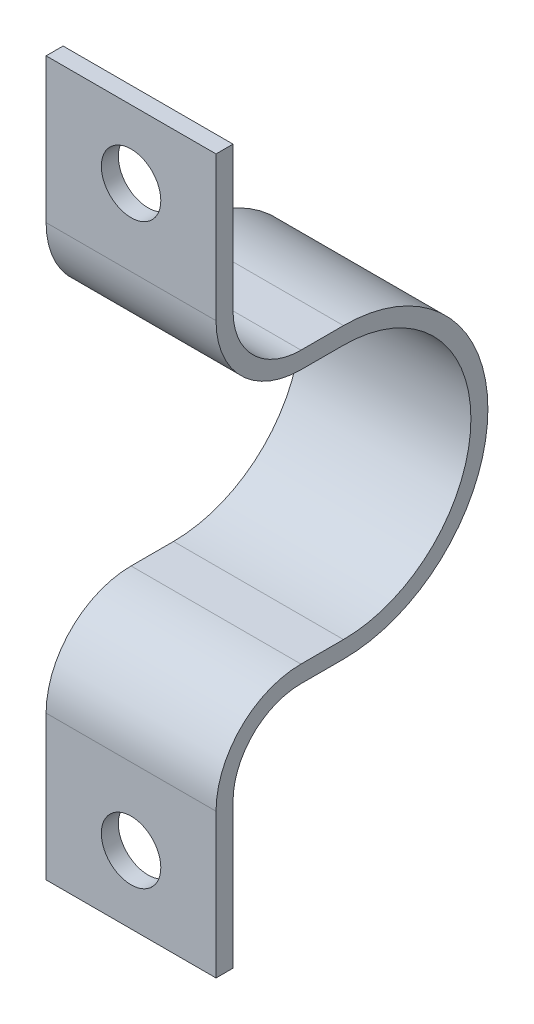
ISO-10303-21;
HEADER;
FILE_DESCRIPTION(('STEP AP214'),'2;1');
FILE_NAME('part.step','',(''),(''),'','','');
FILE_SCHEMA(('AUTOMOTIVE_DESIGN { 1 0 10303 214 1 1 1 1 }'));
ENDSEC;
DATA;
#1=APPLICATION_CONTEXT('core data for automotive mechanical design processes');
#2=APPLICATION_PROTOCOL_DEFINITION('international standard','automotive_design',2000,#1);
#3=PRODUCT_CONTEXT('',#1,'mechanical');
#4=PRODUCT('Part','Part','',(#3));
#5=PRODUCT_RELATED_PRODUCT_CATEGORY('part','',(#4));
#6=PRODUCT_DEFINITION_FORMATION('','',#4);
#7=PRODUCT_DEFINITION_CONTEXT('part definition',#1,'design');
#8=PRODUCT_DEFINITION('design','',#6,#7);
#9=PRODUCT_DEFINITION_SHAPE('','',#8);
#10=(LENGTH_UNIT() NAMED_UNIT(*) SI_UNIT(.MILLI.,.METRE.));
#11=(NAMED_UNIT(*) PLANE_ANGLE_UNIT() SI_UNIT($,.RADIAN.));
#12=(NAMED_UNIT(*) SI_UNIT($,.STERADIAN.) SOLID_ANGLE_UNIT());
#13=UNCERTAINTY_MEASURE_WITH_UNIT(LENGTH_MEASURE(1.E-05),#10,'distance_accuracy_value','');
#14=(GEOMETRIC_REPRESENTATION_CONTEXT(3) GLOBAL_UNCERTAINTY_ASSIGNED_CONTEXT((#13)) GLOBAL_UNIT_ASSIGNED_CONTEXT((#10,
#11,#12)) REPRESENTATION_CONTEXT('',''));
#15=CARTESIAN_POINT('',(0.,0.,0.));
#16=DIRECTION('',(0.,0.,1.));
#17=DIRECTION('',(1.,0.,0.));
#18=AXIS2_PLACEMENT_3D('',#15,#16,#17);
#19=CARTESIAN_POINT('',(15.875,-53.975,0.));
#20=DIRECTION('',(0.,0.,1.));
#21=DIRECTION('',(1.,0.,0.));
#22=AXIS2_PLACEMENT_3D('',#19,#20,#21);
#23=CYLINDRICAL_SURFACE('',#22,5.55625);
#24=CARTESIAN_POINT('',(15.875,-53.975,-3.175));
#25=DIRECTION('',(0.,0.,1.));
#26=DIRECTION('',(1.,0.,0.));
#27=AXIS2_PLACEMENT_3D('',#24,#25,#26);
#28=CIRCLE('',#27,5.55625);
#29=CARTESIAN_POINT('',(21.43125,-53.975,-3.175));
#30=VERTEX_POINT('',#29);
#31=EDGE_CURVE('E144',#30,#30,#28,.T.);
#32=ORIENTED_EDGE('',*,*,#31,.F.);
#33=EDGE_LOOP('',(#32));
#34=FACE_BOUND('',#33,.T.);
#35=CARTESIAN_POINT('',(15.875,-53.975,0.));
#36=DIRECTION('',(0.,0.,1.));
#37=DIRECTION('',(1.,0.,0.));
#38=AXIS2_PLACEMENT_3D('',#35,#36,#37);
#39=CIRCLE('',#38,5.55625);
#40=CARTESIAN_POINT('',(21.43125,-53.975,0.));
#41=VERTEX_POINT('',#40);
#42=EDGE_CURVE('E20',#41,#41,#39,.F.);
#43=ORIENTED_EDGE('',*,*,#42,.F.);
#44=EDGE_LOOP('',(#43));
#45=FACE_BOUND('',#44,.T.);
#46=ADVANCED_FACE('F17',(#34,#45),#23,.F.);
#47=CARTESIAN_POINT('',(15.875,53.975,0.));
#48=DIRECTION('',(0.,0.,1.));
#49=DIRECTION('',(1.,0.,0.));
#50=AXIS2_PLACEMENT_3D('',#47,#48,#49);
#51=CYLINDRICAL_SURFACE('',#50,5.55625);
#52=CARTESIAN_POINT('',(15.875,53.975,-3.175));
#53=DIRECTION('',(0.,0.,1.));
#54=DIRECTION('',(1.,0.,0.));
#55=AXIS2_PLACEMENT_3D('',#52,#53,#54);
#56=CIRCLE('',#55,5.55625);
#57=CARTESIAN_POINT('',(21.43125,53.975,-3.175));
#58=VERTEX_POINT('',#57);
#59=EDGE_CURVE('E236',#58,#58,#56,.T.);
#60=ORIENTED_EDGE('',*,*,#59,.F.);
#61=EDGE_LOOP('',(#60));
#62=FACE_BOUND('',#61,.T.);
#63=CARTESIAN_POINT('',(15.875,53.975,0.));
#64=DIRECTION('',(0.,0.,1.));
#65=DIRECTION('',(1.,0.,0.));
#66=AXIS2_PLACEMENT_3D('',#63,#64,#65);
#67=CIRCLE('',#66,5.55625);
#68=CARTESIAN_POINT('',(21.43125,53.975,0.));
#69=VERTEX_POINT('',#68);
#70=EDGE_CURVE('E220',#69,#69,#67,.F.);
#71=ORIENTED_EDGE('',*,*,#70,.F.);
#72=EDGE_LOOP('',(#71));
#73=FACE_BOUND('',#72,.T.);
#74=ADVANCED_FACE('F291',(#62,#73),#51,.F.);
#75=CARTESIAN_POINT('',(73.1393,-39.6875,-15.875));
#76=DIRECTION('',(-1.,0.,0.));
#77=DIRECTION('',(0.,0.,1.));
#78=AXIS2_PLACEMENT_3D('',#75,#76,#77);
#79=CYLINDRICAL_SURFACE('',#78,15.875);
#80=DIRECTION('',(1.,0.,0.));
#81=VECTOR('',#80,1.);
#82=CARTESIAN_POINT('',(0.,-23.8125,-15.875));
#83=LINE('',#82,#81);
#84=CARTESIAN_POINT('',(0.,-23.8125,-15.875));
#85=VERTEX_POINT('',#84);
#86=CARTESIAN_POINT('',(31.75,-23.8125,-15.875));
#87=VERTEX_POINT('',#86);
#88=EDGE_CURVE('E210',#85,#87,#83,.T.);
#89=ORIENTED_EDGE('',*,*,#88,.F.);
#90=CARTESIAN_POINT('',(0.,-39.6875,-15.875));
#91=DIRECTION('',(-1.,0.,0.));
#92=DIRECTION('',(0.,0.,1.));
#93=AXIS2_PLACEMENT_3D('',#90,#91,#92);
#94=CIRCLE('',#93,15.875);
#95=CARTESIAN_POINT('',(0.,-39.6875,0.));
#96=VERTEX_POINT('',#95);
#97=EDGE_CURVE('E158',#85,#96,#94,.F.);
#98=ORIENTED_EDGE('',*,*,#97,.T.);
#99=DIRECTION('',(1.,0.,0.));
#100=VECTOR('',#99,1.);
#101=CARTESIAN_POINT('',(0.,-39.6875,0.));
#102=LINE('',#101,#100);
#103=CARTESIAN_POINT('',(31.75,-39.6875,0.));
#104=VERTEX_POINT('',#103);
#105=EDGE_CURVE('E252',#104,#96,#102,.F.);
#106=ORIENTED_EDGE('',*,*,#105,.F.);
#107=CARTESIAN_POINT('',(31.75,-39.6875,-15.875));
#108=DIRECTION('',(-1.,0.,0.));
#109=DIRECTION('',(0.,0.,1.));
#110=AXIS2_PLACEMENT_3D('',#107,#108,#109);
#111=CIRCLE('',#110,15.875);
#112=EDGE_CURVE('E172',#87,#104,#111,.F.);
#113=ORIENTED_EDGE('',*,*,#112,.F.);
#114=EDGE_LOOP('',(#89,#98,#106,#113));
#115=FACE_BOUND('',#114,.T.);
#116=ADVANCED_FACE('F297',(#115),#79,.T.);
#117=CARTESIAN_POINT('',(0.,-23.8125,0.));
#118=DIRECTION('',(0.,0.,1.));
#119=DIRECTION('',(1.,0.,0.));
#120=AXIS2_PLACEMENT_3D('',#117,#118,#119);
#121=PLANE('',#120);
#122=ORIENTED_EDGE('',*,*,#42,.T.);
#123=EDGE_LOOP('',(#122));
#124=FACE_BOUND('',#123,.T.);
#125=DIRECTION('',(0.,1.,0.));
#126=VECTOR('',#125,1.);
#127=CARTESIAN_POINT('',(31.75,0.,0.));
#128=LINE('',#127,#126);
#129=CARTESIAN_POINT('',(31.75,-66.675,0.));
#130=VERTEX_POINT('',#129);
#131=EDGE_CURVE('E201',#104,#130,#128,.F.);
#132=ORIENTED_EDGE('',*,*,#131,.F.);
#133=ORIENTED_EDGE('',*,*,#105,.T.);
#134=DIRECTION('',(0.,1.,0.));
#135=VECTOR('',#134,1.);
#136=CARTESIAN_POINT('',(0.,0.,0.));
#137=LINE('',#136,#135);
#138=CARTESIAN_POINT('',(0.,-66.675,0.));
#139=VERTEX_POINT('',#138);
#140=EDGE_CURVE('E130',#96,#139,#137,.F.);
#141=ORIENTED_EDGE('',*,*,#140,.T.);
#142=DIRECTION('',(1.,0.,0.));
#143=VECTOR('',#142,1.);
#144=CARTESIAN_POINT('',(0.,-66.675,0.));
#145=LINE('',#144,#143);
#146=EDGE_CURVE('E135',#130,#139,#145,.F.);
#147=ORIENTED_EDGE('',*,*,#146,.F.);
#148=EDGE_LOOP('',(#132,#133,#141,#147));
#149=FACE_BOUND('',#148,.T.);
#150=ADVANCED_FACE('F295',(#124,#149),#121,.T.);
#151=CARTESIAN_POINT('',(0.,-66.675,0.));
#152=DIRECTION('',(0.,-1.,0.));
#153=DIRECTION('',(0.,0.,-1.));
#154=AXIS2_PLACEMENT_3D('',#151,#152,#153);
#155=PLANE('',#154);
#156=ORIENTED_EDGE('',*,*,#146,.T.);
#157=DIRECTION('',(0.,0.,-1.));
#158=VECTOR('',#157,1.);
#159=CARTESIAN_POINT('',(0.,-66.675,0.));
#160=LINE('',#159,#158);
#161=CARTESIAN_POINT('',(0.,-66.675,-3.175));
#162=VERTEX_POINT('',#161);
#163=EDGE_CURVE('E133',#139,#162,#160,.T.);
#164=ORIENTED_EDGE('',*,*,#163,.T.);
#165=DIRECTION('',(-1.,0.,0.));
#166=VECTOR('',#165,1.);
#167=CARTESIAN_POINT('',(0.,-66.675,-3.175));
#168=LINE('',#167,#166);
#169=CARTESIAN_POINT('',(31.75,-66.675,-3.175));
#170=VERTEX_POINT('',#169);
#171=EDGE_CURVE('E122',#170,#162,#168,.T.);
#172=ORIENTED_EDGE('',*,*,#171,.F.);
#173=DIRECTION('',(0.,0.,-1.));
#174=VECTOR('',#173,1.);
#175=CARTESIAN_POINT('',(31.75,-66.675,0.));
#176=LINE('',#175,#174);
#177=EDGE_CURVE('E198',#130,#170,#176,.T.);
#178=ORIENTED_EDGE('',*,*,#177,.F.);
#179=EDGE_LOOP('',(#156,#164,#172,#178));
#180=FACE_BOUND('',#179,.T.);
#181=ADVANCED_FACE('F134',(#180),#155,.T.);
#182=CARTESIAN_POINT('',(0.,-66.675,-3.175));
#183=DIRECTION('',(0.,0.,-1.));
#184=DIRECTION('',(-1.,0.,0.));
#185=AXIS2_PLACEMENT_3D('',#182,#183,#184);
#186=PLANE('',#185);
#187=ORIENTED_EDGE('',*,*,#31,.T.);
#188=EDGE_LOOP('',(#187));
#189=FACE_BOUND('',#188,.T.);
#190=DIRECTION('',(0.,1.,0.));
#191=VECTOR('',#190,1.);
#192=CARTESIAN_POINT('',(0.,0.,-3.175));
#193=LINE('',#192,#191);
#194=CARTESIAN_POINT('',(0.,-39.6875,-3.175));
#195=VERTEX_POINT('',#194);
#196=EDGE_CURVE('E138',#162,#195,#193,.T.);
#197=ORIENTED_EDGE('',*,*,#196,.T.);
#198=DIRECTION('',(1.,0.,0.));
#199=VECTOR('',#198,1.);
#200=CARTESIAN_POINT('',(-41.3893,-39.6875,-3.175));
#201=LINE('',#200,#199);
#202=CARTESIAN_POINT('',(31.75,-39.6875,-3.175));
#203=VERTEX_POINT('',#202);
#204=EDGE_CURVE('E114',#195,#203,#201,.T.);
#205=ORIENTED_EDGE('',*,*,#204,.T.);
#206=DIRECTION('',(0.,1.,0.));
#207=VECTOR('',#206,1.);
#208=CARTESIAN_POINT('',(31.75,0.,-3.175));
#209=LINE('',#208,#207);
#210=EDGE_CURVE('E142',#170,#203,#209,.T.);
#211=ORIENTED_EDGE('',*,*,#210,.F.);
#212=ORIENTED_EDGE('',*,*,#171,.T.);
#213=EDGE_LOOP('',(#197,#205,#211,#212));
#214=FACE_BOUND('',#213,.T.);
#215=ADVANCED_FACE('F140',(#189,#214),#186,.T.);
#216=CARTESIAN_POINT('',(-41.3893,-39.6875,-15.875));
#217=DIRECTION('',(1.,0.,0.));
#218=DIRECTION('',(0.,0.,-1.));
#219=AXIS2_PLACEMENT_3D('',#216,#217,#218);
#220=CYLINDRICAL_SURFACE('',#219,12.7);
#221=ORIENTED_EDGE('',*,*,#204,.F.);
#222=CARTESIAN_POINT('',(0.,-39.6875,-15.875));
#223=DIRECTION('',(1.,0.,0.));
#224=DIRECTION('',(0.,0.,-1.));
#225=AXIS2_PLACEMENT_3D('',#222,#223,#224);
#226=CIRCLE('',#225,12.7);
#227=CARTESIAN_POINT('',(0.,-26.9875,-15.875));
#228=VERTEX_POINT('',#227);
#229=EDGE_CURVE('E149',#195,#228,#226,.F.);
#230=ORIENTED_EDGE('',*,*,#229,.T.);
#231=DIRECTION('',(1.,0.,0.));
#232=VECTOR('',#231,1.);
#233=CARTESIAN_POINT('',(0.,-26.9875,-15.875));
#234=LINE('',#233,#232);
#235=CARTESIAN_POINT('',(31.75,-26.9875,-15.875));
#236=VERTEX_POINT('',#235);
#237=EDGE_CURVE('E171',#236,#228,#234,.F.);
#238=ORIENTED_EDGE('',*,*,#237,.F.);
#239=CARTESIAN_POINT('',(31.75,-39.6875,-15.875));
#240=DIRECTION('',(1.,0.,0.));
#241=DIRECTION('',(0.,0.,-1.));
#242=AXIS2_PLACEMENT_3D('',#239,#240,#241);
#243=CIRCLE('',#242,12.7);
#244=EDGE_CURVE('E196',#203,#236,#243,.F.);
#245=ORIENTED_EDGE('',*,*,#244,.F.);
#246=EDGE_LOOP('',(#221,#230,#238,#245));
#247=FACE_BOUND('',#246,.T.);
#248=ADVANCED_FACE('F340',(#247),#220,.F.);
#249=CARTESIAN_POINT('',(-41.3893,39.6875,-15.875));
#250=DIRECTION('',(1.,0.,0.));
#251=DIRECTION('',(0.,0.,-1.));
#252=AXIS2_PLACEMENT_3D('',#249,#250,#251);
#253=CYLINDRICAL_SURFACE('',#252,12.7);
#254=DIRECTION('',(1.,0.,0.));
#255=VECTOR('',#254,1.);
#256=CARTESIAN_POINT('',(0.,26.9875,-15.875));
#257=LINE('',#256,#255);
#258=CARTESIAN_POINT('',(0.,26.9875,-15.875));
#259=VERTEX_POINT('',#258);
#260=CARTESIAN_POINT('',(31.75,26.9875,-15.875));
#261=VERTEX_POINT('',#260);
#262=EDGE_CURVE('E204',#259,#261,#257,.T.);
#263=ORIENTED_EDGE('',*,*,#262,.F.);
#264=CARTESIAN_POINT('',(0.,39.6875,-15.875));
#265=DIRECTION('',(1.,0.,0.));
#266=DIRECTION('',(0.,0.,-1.));
#267=AXIS2_PLACEMENT_3D('',#264,#265,#266);
#268=CIRCLE('',#267,12.7);
#269=CARTESIAN_POINT('',(0.,39.6875,-3.175));
#270=VERTEX_POINT('',#269);
#271=EDGE_CURVE('E268',#259,#270,#268,.F.);
#272=ORIENTED_EDGE('',*,*,#271,.T.);
#273=DIRECTION('',(-1.,0.,0.));
#274=VECTOR('',#273,1.);
#275=CARTESIAN_POINT('',(0.,39.6875,-3.175));
#276=LINE('',#275,#274);
#277=CARTESIAN_POINT('',(31.75,39.6875,-3.175));
#278=VERTEX_POINT('',#277);
#279=EDGE_CURVE('E239',#278,#270,#276,.T.);
#280=ORIENTED_EDGE('',*,*,#279,.F.);
#281=CARTESIAN_POINT('',(31.75,39.6875,-15.875));
#282=DIRECTION('',(1.,0.,0.));
#283=DIRECTION('',(0.,0.,-1.));
#284=AXIS2_PLACEMENT_3D('',#281,#282,#283);
#285=CIRCLE('',#284,12.7);
#286=EDGE_CURVE('E190',#261,#278,#285,.F.);
#287=ORIENTED_EDGE('',*,*,#286,.F.);
#288=EDGE_LOOP('',(#263,#272,#280,#287));
#289=FACE_BOUND('',#288,.T.);
#290=ADVANCED_FACE('F328',(#289),#253,.F.);
#291=CARTESIAN_POINT('',(0.,26.9875,-3.175));
#292=DIRECTION('',(0.,0.,-1.));
#293=DIRECTION('',(-1.,0.,0.));
#294=AXIS2_PLACEMENT_3D('',#291,#292,#293);
#295=PLANE('',#294);
#296=ORIENTED_EDGE('',*,*,#59,.T.);
#297=EDGE_LOOP('',(#296));
#298=FACE_BOUND('',#297,.T.);
#299=DIRECTION('',(0.,1.,0.));
#300=VECTOR('',#299,1.);
#301=CARTESIAN_POINT('',(31.75,0.,-3.175));
#302=LINE('',#301,#300);
#303=CARTESIAN_POINT('',(31.75,66.675,-3.175));
#304=VERTEX_POINT('',#303);
#305=EDGE_CURVE('E187',#278,#304,#302,.T.);
#306=ORIENTED_EDGE('',*,*,#305,.F.);
#307=ORIENTED_EDGE('',*,*,#279,.T.);
#308=DIRECTION('',(0.,1.,0.));
#309=VECTOR('',#308,1.);
#310=CARTESIAN_POINT('',(0.,0.,-3.175));
#311=LINE('',#310,#309);
#312=CARTESIAN_POINT('',(0.,66.675,-3.175));
#313=VERTEX_POINT('',#312);
#314=EDGE_CURVE('E231',#270,#313,#311,.T.);
#315=ORIENTED_EDGE('',*,*,#314,.T.);
#316=DIRECTION('',(1.,0.,0.));
#317=VECTOR('',#316,1.);
#318=CARTESIAN_POINT('',(0.,66.675,-3.175));
#319=LINE('',#318,#317);
#320=EDGE_CURVE('E224',#304,#313,#319,.F.);
#321=ORIENTED_EDGE('',*,*,#320,.F.);
#322=EDGE_LOOP('',(#306,#307,#315,#321));
#323=FACE_BOUND('',#322,.T.);
#324=ADVANCED_FACE('F331',(#298,#323),#295,.T.);
#325=CARTESIAN_POINT('',(0.,66.675,-3.175));
#326=DIRECTION('',(0.,1.,0.));
#327=DIRECTION('',(0.,0.,1.));
#328=AXIS2_PLACEMENT_3D('',#325,#326,#327);
#329=PLANE('',#328);
#330=ORIENTED_EDGE('',*,*,#320,.T.);
#331=DIRECTION('',(0.,0.,-1.));
#332=VECTOR('',#331,1.);
#333=CARTESIAN_POINT('',(0.,66.675,0.));
#334=LINE('',#333,#332);
#335=CARTESIAN_POINT('',(0.,66.675,0.));
#336=VERTEX_POINT('',#335);
#337=EDGE_CURVE('E227',#313,#336,#334,.F.);
#338=ORIENTED_EDGE('',*,*,#337,.T.);
#339=DIRECTION('',(1.,0.,0.));
#340=VECTOR('',#339,1.);
#341=CARTESIAN_POINT('',(0.,66.675,0.));
#342=LINE('',#341,#340);
#343=CARTESIAN_POINT('',(31.75,66.675,0.));
#344=VERTEX_POINT('',#343);
#345=EDGE_CURVE('E221',#344,#336,#342,.F.);
#346=ORIENTED_EDGE('',*,*,#345,.F.);
#347=DIRECTION('',(0.,0.,-1.));
#348=VECTOR('',#347,1.);
#349=CARTESIAN_POINT('',(31.75,66.675,0.));
#350=LINE('',#349,#348);
#351=EDGE_CURVE('E184',#304,#344,#350,.F.);
#352=ORIENTED_EDGE('',*,*,#351,.F.);
#353=EDGE_LOOP('',(#330,#338,#346,#352));
#354=FACE_BOUND('',#353,.T.);
#355=ADVANCED_FACE('F381',(#354),#329,.T.);
#356=CARTESIAN_POINT('',(0.,66.675,0.));
#357=DIRECTION('',(0.,0.,1.));
#358=DIRECTION('',(1.,0.,0.));
#359=AXIS2_PLACEMENT_3D('',#356,#357,#358);
#360=PLANE('',#359);
#361=ORIENTED_EDGE('',*,*,#70,.T.);
#362=EDGE_LOOP('',(#361));
#363=FACE_BOUND('',#362,.T.);
#364=DIRECTION('',(0.,1.,0.));
#365=VECTOR('',#364,1.);
#366=CARTESIAN_POINT('',(0.,0.,0.));
#367=LINE('',#366,#365);
#368=CARTESIAN_POINT('',(0.,39.6875,0.));
#369=VERTEX_POINT('',#368);
#370=EDGE_CURVE('E230',#336,#369,#367,.F.);
#371=ORIENTED_EDGE('',*,*,#370,.T.);
#372=DIRECTION('',(-1.,0.,0.));
#373=VECTOR('',#372,1.);
#374=CARTESIAN_POINT('',(73.1393,39.6875,0.));
#375=LINE('',#374,#373);
#376=CARTESIAN_POINT('',(31.75,39.6875,0.));
#377=VERTEX_POINT('',#376);
#378=EDGE_CURVE('E217',#377,#369,#375,.T.);
#379=ORIENTED_EDGE('',*,*,#378,.F.);
#380=DIRECTION('',(0.,1.,0.));
#381=VECTOR('',#380,1.);
#382=CARTESIAN_POINT('',(31.75,0.,0.));
#383=LINE('',#382,#381);
#384=EDGE_CURVE('E181',#344,#377,#383,.F.);
#385=ORIENTED_EDGE('',*,*,#384,.F.);
#386=ORIENTED_EDGE('',*,*,#345,.T.);
#387=EDGE_LOOP('',(#371,#379,#385,#386));
#388=FACE_BOUND('',#387,.T.);
#389=ADVANCED_FACE('F377',(#363,#388),#360,.T.);
#390=CARTESIAN_POINT('',(73.1393,39.6875,-15.875));
#391=DIRECTION('',(-1.,0.,0.));
#392=DIRECTION('',(0.,0.,1.));
#393=AXIS2_PLACEMENT_3D('',#390,#391,#392);
#394=CYLINDRICAL_SURFACE('',#393,15.875);
#395=ORIENTED_EDGE('',*,*,#378,.T.);
#396=CARTESIAN_POINT('',(0.,39.6875,-15.875));
#397=DIRECTION('',(-1.,0.,0.));
#398=DIRECTION('',(0.,0.,1.));
#399=AXIS2_PLACEMENT_3D('',#396,#397,#398);
#400=CIRCLE('',#399,15.875);
#401=CARTESIAN_POINT('',(0.,23.8125,-15.875));
#402=VERTEX_POINT('',#401);
#403=EDGE_CURVE('E266',#369,#402,#400,.F.);
#404=ORIENTED_EDGE('',*,*,#403,.T.);
#405=DIRECTION('',(1.,0.,0.));
#406=VECTOR('',#405,1.);
#407=CARTESIAN_POINT('',(0.,23.8125,-15.875));
#408=LINE('',#407,#406);
#409=CARTESIAN_POINT('',(31.75,23.8125,-15.875));
#410=VERTEX_POINT('',#409);
#411=EDGE_CURVE('E214',#410,#402,#408,.F.);
#412=ORIENTED_EDGE('',*,*,#411,.F.);
#413=CARTESIAN_POINT('',(31.75,39.6875,-15.875));
#414=DIRECTION('',(-1.,0.,0.));
#415=DIRECTION('',(0.,0.,1.));
#416=AXIS2_PLACEMENT_3D('',#413,#414,#415);
#417=CIRCLE('',#416,15.875);
#418=EDGE_CURVE('E180',#377,#410,#417,.F.);
#419=ORIENTED_EDGE('',*,*,#418,.F.);
#420=EDGE_LOOP('',(#395,#404,#412,#419));
#421=FACE_BOUND('',#420,.T.);
#422=ADVANCED_FACE('F373',(#421),#394,.T.);
#423=CARTESIAN_POINT('',(0.,23.8125,0.));
#424=DIRECTION('',(0.,-1.,0.));
#425=DIRECTION('',(0.,0.,-1.));
#426=AXIS2_PLACEMENT_3D('',#423,#424,#425);
#427=PLANE('',#426);
#428=DIRECTION('',(0.,0.,-1.));
#429=VECTOR('',#428,1.);
#430=CARTESIAN_POINT('',(31.75,23.8125,0.));
#431=LINE('',#430,#429);
#432=CARTESIAN_POINT('',(31.75,23.8125,-23.8125));
#433=VERTEX_POINT('',#432);
#434=EDGE_CURVE('E177',#410,#433,#431,.T.);
#435=ORIENTED_EDGE('',*,*,#434,.F.);
#436=ORIENTED_EDGE('',*,*,#411,.T.);
#437=DIRECTION('',(0.,0.,-1.));
#438=VECTOR('',#437,1.);
#439=CARTESIAN_POINT('',(0.,23.8125,0.));
#440=LINE('',#439,#438);
#441=CARTESIAN_POINT('',(0.,23.8125,-23.8125));
#442=VERTEX_POINT('',#441);
#443=EDGE_CURVE('E265',#402,#442,#440,.T.);
#444=ORIENTED_EDGE('',*,*,#443,.T.);
#445=DIRECTION('',(1.,0.,0.));
#446=VECTOR('',#445,1.);
#447=CARTESIAN_POINT('',(0.,23.8125,-23.8125));
#448=LINE('',#447,#446);
#449=EDGE_CURVE('E211',#442,#433,#448,.T.);
#450=ORIENTED_EDGE('',*,*,#449,.T.);
#451=EDGE_LOOP('',(#435,#436,#444,#450));
#452=FACE_BOUND('',#451,.T.);
#453=ADVANCED_FACE('F369',(#452),#427,.T.);
#454=CARTESIAN_POINT('',(0.,0.,-23.8125));
#455=DIRECTION('',(1.,0.,0.));
#456=DIRECTION('',(0.,0.,-1.));
#457=AXIS2_PLACEMENT_3D('',#454,#455,#456);
#458=CYLINDRICAL_SURFACE('',#457,23.8125);
#459=CARTESIAN_POINT('',(31.75,0.,-23.8125));
#460=DIRECTION('',(1.,0.,0.));
#461=DIRECTION('',(0.,0.,-1.));
#462=AXIS2_PLACEMENT_3D('',#459,#460,#461);
#463=CIRCLE('',#462,23.8125);
#464=CARTESIAN_POINT('',(31.75,-23.8125,-23.8125));
#465=VERTEX_POINT('',#464);
#466=EDGE_CURVE('E176',#433,#465,#463,.F.);
#467=ORIENTED_EDGE('',*,*,#466,.F.);
#468=ORIENTED_EDGE('',*,*,#449,.F.);
#469=CARTESIAN_POINT('',(0.,0.,-23.8125));
#470=DIRECTION('',(1.,0.,0.));
#471=DIRECTION('',(0.,0.,-1.));
#472=AXIS2_PLACEMENT_3D('',#469,#470,#471);
#473=CIRCLE('',#472,23.8125);
#474=CARTESIAN_POINT('',(0.,-23.8125,-23.8125));
#475=VERTEX_POINT('',#474);
#476=EDGE_CURVE('E263',#442,#475,#473,.F.);
#477=ORIENTED_EDGE('',*,*,#476,.T.);
#478=DIRECTION('',(1.,0.,0.));
#479=VECTOR('',#478,1.);
#480=CARTESIAN_POINT('',(0.,-23.8125,-23.8125));
#481=LINE('',#480,#479);
#482=EDGE_CURVE('E207',#465,#475,#481,.F.);
#483=ORIENTED_EDGE('',*,*,#482,.F.);
#484=EDGE_LOOP('',(#467,#468,#477,#483));
#485=FACE_BOUND('',#484,.T.);
#486=ADVANCED_FACE('F366',(#485),#458,.F.);
#487=CARTESIAN_POINT('',(0.,-23.8125,-23.8125));
#488=DIRECTION('',(0.,1.,0.));
#489=DIRECTION('',(0.,0.,1.));
#490=AXIS2_PLACEMENT_3D('',#487,#488,#489);
#491=PLANE('',#490);
#492=DIRECTION('',(0.,0.,-1.));
#493=VECTOR('',#492,1.);
#494=CARTESIAN_POINT('',(0.,-23.8125,0.));
#495=LINE('',#494,#493);
#496=EDGE_CURVE('E167',#475,#85,#495,.F.);
#497=ORIENTED_EDGE('',*,*,#496,.T.);
#498=ORIENTED_EDGE('',*,*,#88,.T.);
#499=DIRECTION('',(0.,0.,-1.));
#500=VECTOR('',#499,1.);
#501=CARTESIAN_POINT('',(31.75,-23.8125,0.));
#502=LINE('',#501,#500);
#503=EDGE_CURVE('E173',#465,#87,#502,.F.);
#504=ORIENTED_EDGE('',*,*,#503,.F.);
#505=ORIENTED_EDGE('',*,*,#482,.T.);
#506=EDGE_LOOP('',(#497,#498,#504,#505));
#507=FACE_BOUND('',#506,.T.);
#508=ADVANCED_FACE('F363',(#507),#491,.T.);
#509=CARTESIAN_POINT('',(0.,26.9875,-23.8125));
#510=DIRECTION('',(0.,1.,0.));
#511=DIRECTION('',(0.,0.,1.));
#512=AXIS2_PLACEMENT_3D('',#509,#510,#511);
#513=PLANE('',#512);
#514=DIRECTION('',(0.,0.,-1.));
#515=VECTOR('',#514,1.);
#516=CARTESIAN_POINT('',(0.,26.9875,0.));
#517=LINE('',#516,#515);
#518=CARTESIAN_POINT('',(0.,26.9875,-23.8125));
#519=VERTEX_POINT('',#518);
#520=EDGE_CURVE('E269',#519,#259,#517,.F.);
#521=ORIENTED_EDGE('',*,*,#520,.T.);
#522=ORIENTED_EDGE('',*,*,#262,.T.);
#523=DIRECTION('',(0.,0.,-1.));
#524=VECTOR('',#523,1.);
#525=CARTESIAN_POINT('',(31.75,26.9875,0.));
#526=LINE('',#525,#524);
#527=CARTESIAN_POINT('',(31.75,26.9875,-23.8125));
#528=VERTEX_POINT('',#527);
#529=EDGE_CURVE('E193',#528,#261,#526,.F.);
#530=ORIENTED_EDGE('',*,*,#529,.F.);
#531=DIRECTION('',(1.,0.,0.));
#532=VECTOR('',#531,1.);
#533=CARTESIAN_POINT('',(0.,26.9875,-23.8125));
#534=LINE('',#533,#532);
#535=EDGE_CURVE('E164',#519,#528,#534,.T.);
#536=ORIENTED_EDGE('',*,*,#535,.F.);
#537=EDGE_LOOP('',(#521,#522,#530,#536));
#538=FACE_BOUND('',#537,.T.);
#539=ADVANCED_FACE('F323',(#538),#513,.T.);
#540=CARTESIAN_POINT('',(31.75,0.,0.));
#541=DIRECTION('',(1.,0.,0.));
#542=DIRECTION('',(0.,0.,-1.));
#543=AXIS2_PLACEMENT_3D('',#540,#541,#542);
#544=PLANE('',#543);
#545=ORIENTED_EDGE('',*,*,#503,.T.);
#546=ORIENTED_EDGE('',*,*,#112,.T.);
#547=ORIENTED_EDGE('',*,*,#131,.T.);
#548=ORIENTED_EDGE('',*,*,#177,.T.);
#549=ORIENTED_EDGE('',*,*,#210,.T.);
#550=ORIENTED_EDGE('',*,*,#244,.T.);
#551=DIRECTION('',(0.,0.,-1.));
#552=VECTOR('',#551,1.);
#553=CARTESIAN_POINT('',(31.75,-26.9875,-3.175));
#554=LINE('',#553,#552);
#555=CARTESIAN_POINT('',(31.75,-26.9875,-23.8125));
#556=VERTEX_POINT('',#555);
#557=EDGE_CURVE('E168',#556,#236,#554,.F.);
#558=ORIENTED_EDGE('',*,*,#557,.F.);
#559=CARTESIAN_POINT('',(31.75,0.,-23.8125));
#560=DIRECTION('',(1.,0.,0.));
#561=DIRECTION('',(0.,0.,-1.));
#562=AXIS2_PLACEMENT_3D('',#559,#560,#561);
#563=CIRCLE('',#562,26.9875);
#564=EDGE_CURVE('E163',#528,#556,#563,.F.);
#565=ORIENTED_EDGE('',*,*,#564,.F.);
#566=ORIENTED_EDGE('',*,*,#529,.T.);
#567=ORIENTED_EDGE('',*,*,#286,.T.);
#568=ORIENTED_EDGE('',*,*,#305,.T.);
#569=ORIENTED_EDGE('',*,*,#351,.T.);
#570=ORIENTED_EDGE('',*,*,#384,.T.);
#571=ORIENTED_EDGE('',*,*,#418,.T.);
#572=ORIENTED_EDGE('',*,*,#434,.T.);
#573=ORIENTED_EDGE('',*,*,#466,.T.);
#574=EDGE_LOOP('',(#545,#546,#547,#548,#549,#550,#558,#565,#566,#567,#568,#569,#570,#571,#572,#573));
#575=FACE_BOUND('',#574,.T.);
#576=ADVANCED_FACE('F302',(#575),#544,.T.);
#577=CARTESIAN_POINT('',(0.,-26.9875,-3.175));
#578=DIRECTION('',(0.,-1.,0.));
#579=DIRECTION('',(0.,0.,-1.));
#580=AXIS2_PLACEMENT_3D('',#577,#578,#579);
#581=PLANE('',#580);
#582=ORIENTED_EDGE('',*,*,#557,.T.);
#583=ORIENTED_EDGE('',*,*,#237,.T.);
#584=DIRECTION('',(0.,0.,-1.));
#585=VECTOR('',#584,1.);
#586=CARTESIAN_POINT('',(0.,-26.9875,0.));
#587=LINE('',#586,#585);
#588=CARTESIAN_POINT('',(0.,-26.9875,-23.8125));
#589=VERTEX_POINT('',#588);
#590=EDGE_CURVE('E35',#228,#589,#587,.T.);
#591=ORIENTED_EDGE('',*,*,#590,.T.);
#592=DIRECTION('',(1.,0.,0.));
#593=VECTOR('',#592,1.);
#594=CARTESIAN_POINT('',(0.,-26.9875,-23.8125));
#595=LINE('',#594,#593);
#596=EDGE_CURVE('E26',#556,#589,#595,.F.);
#597=ORIENTED_EDGE('',*,*,#596,.F.);
#598=EDGE_LOOP('',(#582,#583,#591,#597));
#599=FACE_BOUND('',#598,.T.);
#600=ADVANCED_FACE('F337',(#599),#581,.T.);
#601=CARTESIAN_POINT('',(0.,0.,0.));
#602=DIRECTION('',(1.,0.,0.));
#603=DIRECTION('',(0.,0.,-1.));
#604=AXIS2_PLACEMENT_3D('',#601,#602,#603);
#605=PLANE('',#604);
#606=ORIENTED_EDGE('',*,*,#476,.F.);
#607=ORIENTED_EDGE('',*,*,#443,.F.);
#608=ORIENTED_EDGE('',*,*,#403,.F.);
#609=ORIENTED_EDGE('',*,*,#370,.F.);
#610=ORIENTED_EDGE('',*,*,#337,.F.);
#611=ORIENTED_EDGE('',*,*,#314,.F.);
#612=ORIENTED_EDGE('',*,*,#271,.F.);
#613=ORIENTED_EDGE('',*,*,#520,.F.);
#614=CARTESIAN_POINT('',(0.,0.,-23.8125));
#615=DIRECTION('',(1.,0.,0.));
#616=DIRECTION('',(0.,0.,-1.));
#617=AXIS2_PLACEMENT_3D('',#614,#615,#616);
#618=CIRCLE('',#617,26.9875);
#619=EDGE_CURVE('E11',#589,#519,#618,.T.);
#620=ORIENTED_EDGE('',*,*,#619,.F.);
#621=ORIENTED_EDGE('',*,*,#590,.F.);
#622=ORIENTED_EDGE('',*,*,#229,.F.);
#623=ORIENTED_EDGE('',*,*,#196,.F.);
#624=ORIENTED_EDGE('',*,*,#163,.F.);
#625=ORIENTED_EDGE('',*,*,#140,.F.);
#626=ORIENTED_EDGE('',*,*,#97,.F.);
#627=ORIENTED_EDGE('',*,*,#496,.F.);
#628=EDGE_LOOP('',(#606,#607,#608,#609,#610,#611,#612,#613,#620,#621,#622,#623,#624,#625,#626,#627));
#629=FACE_BOUND('',#628,.T.);
#630=ADVANCED_FACE('F148',(#629),#605,.F.);
#631=CARTESIAN_POINT('',(0.,0.,-23.8125));
#632=DIRECTION('',(1.,0.,0.));
#633=DIRECTION('',(0.,0.,-1.));
#634=AXIS2_PLACEMENT_3D('',#631,#632,#633);
#635=CYLINDRICAL_SURFACE('',#634,26.9875);
#636=ORIENTED_EDGE('',*,*,#596,.T.);
#637=ORIENTED_EDGE('',*,*,#619,.T.);
#638=ORIENTED_EDGE('',*,*,#535,.T.);
#639=ORIENTED_EDGE('',*,*,#564,.T.);
#640=EDGE_LOOP('',(#636,#637,#638,#639));
#641=FACE_BOUND('',#640,.T.);
#642=ADVANCED_FACE('F336',(#641),#635,.T.);
#643=CLOSED_SHELL('',(#46,#74,#116,#150,#181,#215,#248,#290,#324,#355,#389,#422,#453,#486,#508,
#539,#576,#600,#630,#642));
#644=MANIFOLD_SOLID_BREP('B1',#643);
#645=ADVANCED_BREP_SHAPE_REPRESENTATION('',(#18,#644),#14);
#646=SHAPE_DEFINITION_REPRESENTATION(#9,#645);
ENDSEC;
END-ISO-10303-21;
